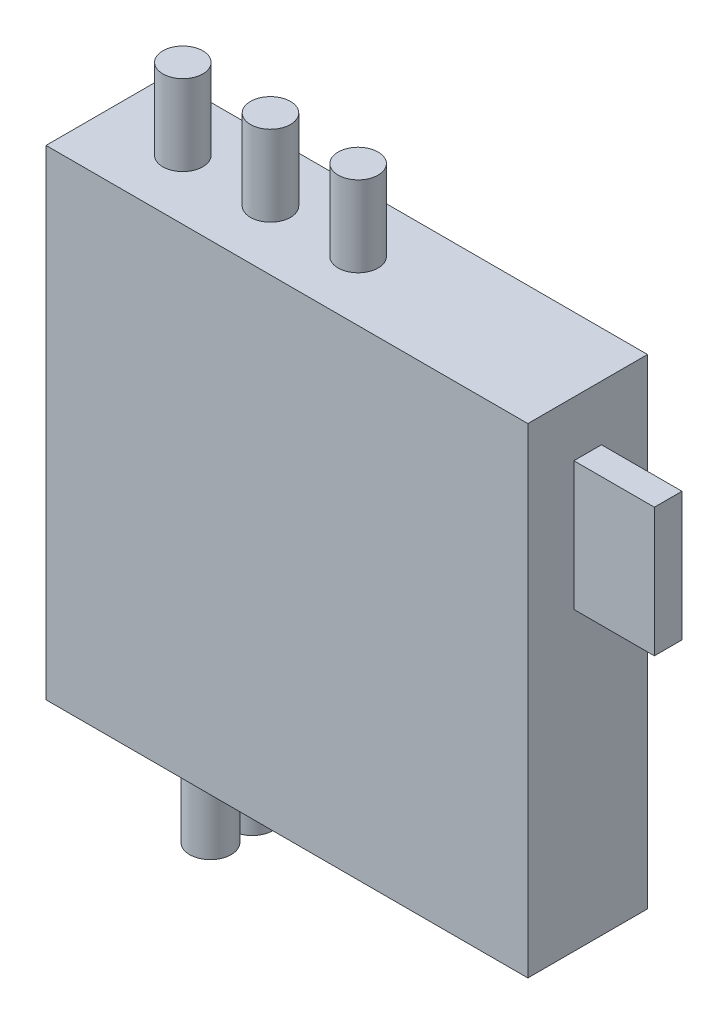
ISO-10303-21;
HEADER;
FILE_DESCRIPTION(('STEP AP214'),'2;1');
FILE_NAME('part.step','',(''),(''),'','','');
FILE_SCHEMA(('AUTOMOTIVE_DESIGN { 1 0 10303 214 1 1 1 1 }'));
ENDSEC;
DATA;
#1=APPLICATION_CONTEXT('core data for automotive mechanical design processes');
#2=APPLICATION_PROTOCOL_DEFINITION('international standard','automotive_design',2000,#1);
#3=PRODUCT_CONTEXT('',#1,'mechanical');
#4=PRODUCT('Part','Part','',(#3));
#5=PRODUCT_RELATED_PRODUCT_CATEGORY('part','',(#4));
#6=PRODUCT_DEFINITION_FORMATION('','',#4);
#7=PRODUCT_DEFINITION_CONTEXT('part definition',#1,'design');
#8=PRODUCT_DEFINITION('design','',#6,#7);
#9=PRODUCT_DEFINITION_SHAPE('','',#8);
#10=(LENGTH_UNIT() NAMED_UNIT(*) SI_UNIT(.MILLI.,.METRE.));
#11=(NAMED_UNIT(*) PLANE_ANGLE_UNIT() SI_UNIT($,.RADIAN.));
#12=(NAMED_UNIT(*) SI_UNIT($,.STERADIAN.) SOLID_ANGLE_UNIT());
#13=UNCERTAINTY_MEASURE_WITH_UNIT(LENGTH_MEASURE(1.E-05),#10,'distance_accuracy_value','');
#14=(GEOMETRIC_REPRESENTATION_CONTEXT(3) GLOBAL_UNCERTAINTY_ASSIGNED_CONTEXT((#13)) GLOBAL_UNIT_ASSIGNED_CONTEXT((#10,
#11,#12)) REPRESENTATION_CONTEXT('',''));
#15=CARTESIAN_POINT('',(0.,0.,0.));
#16=DIRECTION('',(0.,0.,1.));
#17=DIRECTION('',(1.,0.,0.));
#18=AXIS2_PLACEMENT_3D('',#15,#16,#17);
#19=CARTESIAN_POINT('',(26.19,52.2,-6.50499999999999));
#20=DIRECTION('',(-1.,0.,0.));
#21=DIRECTION('',(0.,0.,1.));
#22=AXIS2_PLACEMENT_3D('',#19,#20,#21);
#23=PLANE('',#22);
#24=DIRECTION('',(0.,0.,-1.));
#25=VECTOR('',#24,1.);
#26=CARTESIAN_POINT('',(26.19,0.,-6.50499999999999));
#27=LINE('',#26,#25);
#28=CARTESIAN_POINT('',(26.19,0.,6.505));
#29=VERTEX_POINT('',#28);
#30=CARTESIAN_POINT('',(26.19,0.,-6.50499999999999));
#31=VERTEX_POINT('',#30);
#32=EDGE_CURVE('E171',#29,#31,#27,.T.);
#33=ORIENTED_EDGE('',*,*,#32,.T.);
#34=DIRECTION('',(0.,-1.,0.));
#35=VECTOR('',#34,1.);
#36=CARTESIAN_POINT('',(26.19,52.2,-6.50499999999999));
#37=LINE('',#36,#35);
#38=CARTESIAN_POINT('',(26.19,52.2,-6.50499999999999));
#39=VERTEX_POINT('',#38);
#40=EDGE_CURVE('E176',#39,#31,#37,.T.);
#41=ORIENTED_EDGE('',*,*,#40,.F.);
#42=DIRECTION('',(0.,0.,-1.));
#43=VECTOR('',#42,1.);
#44=CARTESIAN_POINT('',(26.19,52.2,-6.50499999999999));
#45=LINE('',#44,#43);
#46=CARTESIAN_POINT('',(26.19,52.2,6.505));
#47=VERTEX_POINT('',#46);
#48=EDGE_CURVE('E162',#47,#39,#45,.T.);
#49=ORIENTED_EDGE('',*,*,#48,.F.);
#50=DIRECTION('',(0.,-1.,0.));
#51=VECTOR('',#50,1.);
#52=CARTESIAN_POINT('',(26.19,52.2,6.505));
#53=LINE('',#52,#51);
#54=EDGE_CURVE('E179',#47,#29,#53,.T.);
#55=ORIENTED_EDGE('',*,*,#54,.T.);
#56=EDGE_LOOP('',(#33,#41,#49,#55));
#57=FACE_BOUND('',#56,.T.);
#58=DIRECTION('',(0.,-1.,0.));
#59=VECTOR('',#58,1.);
#60=CARTESIAN_POINT('',(26.19,46.2,1.5));
#61=LINE('',#60,#59);
#62=CARTESIAN_POINT('',(26.19,46.2,1.5));
#63=VERTEX_POINT('',#62);
#64=CARTESIAN_POINT('',(26.19,32.2,1.5));
#65=VERTEX_POINT('',#64);
#66=EDGE_CURVE('E125',#63,#65,#61,.T.);
#67=ORIENTED_EDGE('',*,*,#66,.F.);
#68=DIRECTION('',(0.,0.,1.));
#69=VECTOR('',#68,1.);
#70=CARTESIAN_POINT('',(26.19,46.2,1.5));
#71=LINE('',#70,#69);
#72=CARTESIAN_POINT('',(26.19,46.2,-1.5));
#73=VERTEX_POINT('',#72);
#74=EDGE_CURVE('E122',#73,#63,#71,.T.);
#75=ORIENTED_EDGE('',*,*,#74,.F.);
#76=DIRECTION('',(0.,1.,0.));
#77=VECTOR('',#76,1.);
#78=CARTESIAN_POINT('',(26.19,46.2,-1.5));
#79=LINE('',#78,#77);
#80=CARTESIAN_POINT('',(26.19,32.2,-1.5));
#81=VERTEX_POINT('',#80);
#82=EDGE_CURVE('E60',#81,#73,#79,.T.);
#83=ORIENTED_EDGE('',*,*,#82,.F.);
#84=DIRECTION('',(0.,0.,-1.));
#85=VECTOR('',#84,1.);
#86=CARTESIAN_POINT('',(26.19,32.2,1.5));
#87=LINE('',#86,#85);
#88=EDGE_CURVE('E55',#65,#81,#87,.T.);
#89=ORIENTED_EDGE('',*,*,#88,.F.);
#90=EDGE_LOOP('',(#67,#75,#83,#89));
#91=FACE_BOUND('',#90,.T.);
#92=ADVANCED_FACE('F40',(#57,#91),#23,.F.);
#93=CARTESIAN_POINT('',(-26.19,52.2,-6.50499999999999));
#94=DIRECTION('',(1.,0.,0.));
#95=DIRECTION('',(0.,0.,-1.));
#96=AXIS2_PLACEMENT_3D('',#93,#94,#95);
#97=PLANE('',#96);
#98=DIRECTION('',(0.,0.,1.));
#99=VECTOR('',#98,1.);
#100=CARTESIAN_POINT('',(-26.19,0.,-6.50499999999999));
#101=LINE('',#100,#99);
#102=CARTESIAN_POINT('',(-26.19,0.,-6.50499999999999));
#103=VERTEX_POINT('',#102);
#104=CARTESIAN_POINT('',(-26.19,0.,6.505));
#105=VERTEX_POINT('',#104);
#106=EDGE_CURVE('E155',#103,#105,#101,.T.);
#107=ORIENTED_EDGE('',*,*,#106,.T.);
#108=DIRECTION('',(0.,-1.,0.));
#109=VECTOR('',#108,1.);
#110=CARTESIAN_POINT('',(-26.19,52.2,6.505));
#111=LINE('',#110,#109);
#112=CARTESIAN_POINT('',(-26.19,52.2,6.505));
#113=VERTEX_POINT('',#112);
#114=EDGE_CURVE('E182',#113,#105,#111,.T.);
#115=ORIENTED_EDGE('',*,*,#114,.F.);
#116=DIRECTION('',(0.,0.,1.));
#117=VECTOR('',#116,1.);
#118=CARTESIAN_POINT('',(-26.19,52.2,-6.50499999999999));
#119=LINE('',#118,#117);
#120=CARTESIAN_POINT('',(-26.19,52.2,-6.50499999999999));
#121=VERTEX_POINT('',#120);
#122=EDGE_CURVE('E156',#121,#113,#119,.T.);
#123=ORIENTED_EDGE('',*,*,#122,.F.);
#124=DIRECTION('',(0.,-1.,0.));
#125=VECTOR('',#124,1.);
#126=CARTESIAN_POINT('',(-26.19,52.2,-6.50499999999999));
#127=LINE('',#126,#125);
#128=EDGE_CURVE('E166',#121,#103,#127,.T.);
#129=ORIENTED_EDGE('',*,*,#128,.T.);
#130=EDGE_LOOP('',(#107,#115,#123,#129));
#131=FACE_BOUND('',#130,.T.);
#132=ADVANCED_FACE('F42',(#131),#97,.F.);
#133=CARTESIAN_POINT('',(-26.19,52.2,6.505));
#134=DIRECTION('',(0.,0.,-1.));
#135=DIRECTION('',(-1.,0.,0.));
#136=AXIS2_PLACEMENT_3D('',#133,#134,#135);
#137=PLANE('',#136);
#138=DIRECTION('',(1.,0.,0.));
#139=VECTOR('',#138,1.);
#140=CARTESIAN_POINT('',(-26.19,0.,6.505));
#141=LINE('',#140,#139);
#142=EDGE_CURVE('E169',#105,#29,#141,.T.);
#143=ORIENTED_EDGE('',*,*,#142,.T.);
#144=ORIENTED_EDGE('',*,*,#54,.F.);
#145=DIRECTION('',(1.,0.,0.));
#146=VECTOR('',#145,1.);
#147=CARTESIAN_POINT('',(-26.19,52.2,6.505));
#148=LINE('',#147,#146);
#149=EDGE_CURVE('E159',#113,#47,#148,.T.);
#150=ORIENTED_EDGE('',*,*,#149,.F.);
#151=ORIENTED_EDGE('',*,*,#114,.T.);
#152=EDGE_LOOP('',(#143,#144,#150,#151));
#153=FACE_BOUND('',#152,.T.);
#154=ADVANCED_FACE('F210',(#153),#137,.F.);
#155=CARTESIAN_POINT('',(-26.19,52.2,-6.50499999999999));
#156=DIRECTION('',(0.,0.,1.));
#157=DIRECTION('',(1.,0.,0.));
#158=AXIS2_PLACEMENT_3D('',#155,#156,#157);
#159=PLANE('',#158);
#160=DIRECTION('',(-1.,0.,0.));
#161=VECTOR('',#160,1.);
#162=CARTESIAN_POINT('',(-26.19,0.,-6.50499999999999));
#163=LINE('',#162,#161);
#164=EDGE_CURVE('E160',#31,#103,#163,.T.);
#165=ORIENTED_EDGE('',*,*,#164,.T.);
#166=ORIENTED_EDGE('',*,*,#128,.F.);
#167=DIRECTION('',(-1.,0.,0.));
#168=VECTOR('',#167,1.);
#169=CARTESIAN_POINT('',(-26.19,52.2,-6.50499999999999));
#170=LINE('',#169,#168);
#171=EDGE_CURVE('E164',#39,#121,#170,.T.);
#172=ORIENTED_EDGE('',*,*,#171,.F.);
#173=ORIENTED_EDGE('',*,*,#40,.T.);
#174=EDGE_LOOP('',(#165,#166,#172,#173));
#175=FACE_BOUND('',#174,.T.);
#176=ADVANCED_FACE('F204',(#175),#159,.F.);
#177=CARTESIAN_POINT('',(0.,52.2,0.));
#178=DIRECTION('',(0.,1.,0.));
#179=DIRECTION('',(0.,0.,1.));
#180=AXIS2_PLACEMENT_3D('',#177,#178,#179);
#181=PLANE('',#180);
#182=CARTESIAN_POINT('',(1.23499999999999,52.2,-2.661905372734E-13));
#183=DIRECTION('',(0.,1.,0.));
#184=DIRECTION('',(0.,0.,1.));
#185=AXIS2_PLACEMENT_3D('',#182,#183,#184);
#186=CIRCLE('',#185,2.175);
#187=CARTESIAN_POINT('',(1.23499999999999,52.2,2.17499999999973));
#188=VERTEX_POINT('',#187);
#189=EDGE_CURVE('E129',#188,#188,#186,.T.);
#190=ORIENTED_EDGE('',*,*,#189,.F.);
#191=EDGE_LOOP('',(#190));
#192=FACE_BOUND('',#191,.T.);
#193=CARTESIAN_POINT('',(-8.29500000000001,52.2,-1.330952686367E-13));
#194=DIRECTION('',(0.,1.,0.));
#195=DIRECTION('',(0.,0.,1.));
#196=AXIS2_PLACEMENT_3D('',#193,#194,#195);
#197=CIRCLE('',#196,2.175);
#198=CARTESIAN_POINT('',(-8.29500000000001,52.2,2.17499999999987));
#199=VERTEX_POINT('',#198);
#200=EDGE_CURVE('E138',#199,#199,#197,.T.);
#201=ORIENTED_EDGE('',*,*,#200,.F.);
#202=EDGE_LOOP('',(#201));
#203=FACE_BOUND('',#202,.T.);
#204=CARTESIAN_POINT('',(-17.8250000000001,52.2,3.66026653431106E-13));
#205=DIRECTION('',(0.,1.,0.));
#206=DIRECTION('',(0.,0.,1.));
#207=AXIS2_PLACEMENT_3D('',#204,#205,#206);
#208=CIRCLE('',#207,2.17500000000019);
#209=CARTESIAN_POINT('',(-17.8250000000001,52.2,2.17500000000056));
#210=VERTEX_POINT('',#209);
#211=EDGE_CURVE('E141',#210,#210,#208,.T.);
#212=ORIENTED_EDGE('',*,*,#211,.F.);
#213=EDGE_LOOP('',(#212));
#214=FACE_BOUND('',#213,.T.);
#215=ORIENTED_EDGE('',*,*,#122,.T.);
#216=ORIENTED_EDGE('',*,*,#149,.T.);
#217=ORIENTED_EDGE('',*,*,#48,.T.);
#218=ORIENTED_EDGE('',*,*,#171,.T.);
#219=EDGE_LOOP('',(#215,#216,#217,#218));
#220=FACE_BOUND('',#219,.T.);
#221=ADVANCED_FACE('F192',(#192,#203,#214,#220),#181,.T.);
#222=CARTESIAN_POINT('',(0.,0.,0.));
#223=DIRECTION('',(0.,1.,0.));
#224=DIRECTION('',(0.,0.,1.));
#225=AXIS2_PLACEMENT_3D('',#222,#223,#224);
#226=PLANE('',#225);
#227=CARTESIAN_POINT('',(-12.55,0.,-2.27));
#228=DIRECTION('',(0.,1.,0.));
#229=DIRECTION('',(0.,0.,1.));
#230=AXIS2_PLACEMENT_3D('',#227,#228,#229);
#231=CIRCLE('',#230,2.26);
#232=CARTESIAN_POINT('',(-12.55,0.,-0.00999999999999742));
#233=VERTEX_POINT('',#232);
#234=EDGE_CURVE('E11',#233,#233,#231,.F.);
#235=ORIENTED_EDGE('',*,*,#234,.F.);
#236=EDGE_LOOP('',(#235));
#237=FACE_BOUND('',#236,.T.);
#238=CARTESIAN_POINT('',(-12.55,0.,2.27));
#239=DIRECTION('',(0.,1.,0.));
#240=DIRECTION('',(0.,0.,1.));
#241=AXIS2_PLACEMENT_3D('',#238,#239,#240);
#242=CIRCLE('',#241,2.26);
#243=CARTESIAN_POINT('',(-12.55,0.,4.53));
#244=VERTEX_POINT('',#243);
#245=EDGE_CURVE('E48',#244,#244,#242,.F.);
#246=ORIENTED_EDGE('',*,*,#245,.F.);
#247=EDGE_LOOP('',(#246));
#248=FACE_BOUND('',#247,.T.);
#249=ORIENTED_EDGE('',*,*,#106,.F.);
#250=ORIENTED_EDGE('',*,*,#164,.F.);
#251=ORIENTED_EDGE('',*,*,#32,.F.);
#252=ORIENTED_EDGE('',*,*,#142,.F.);
#253=EDGE_LOOP('',(#249,#250,#251,#252));
#254=FACE_BOUND('',#253,.T.);
#255=ADVANCED_FACE('F189',(#237,#248,#254),#226,.F.);
#256=CARTESIAN_POINT('',(-12.55,-8.75,2.27));
#257=DIRECTION('',(0.,1.,0.));
#258=DIRECTION('',(0.,0.,1.));
#259=AXIS2_PLACEMENT_3D('',#256,#257,#258);
#260=CYLINDRICAL_SURFACE('',#259,2.26);
#261=CARTESIAN_POINT('',(-12.55,-8.75,2.27));
#262=DIRECTION('',(0.,-1.,0.));
#263=DIRECTION('',(0.,0.,-1.));
#264=AXIS2_PLACEMENT_3D('',#261,#262,#263);
#265=CIRCLE('',#264,2.26);
#266=CARTESIAN_POINT('',(-12.55,-8.75,0.0100000000000009));
#267=VERTEX_POINT('',#266);
#268=EDGE_CURVE('E152',#267,#267,#265,.T.);
#269=ORIENTED_EDGE('',*,*,#268,.F.);
#270=EDGE_LOOP('',(#269));
#271=FACE_BOUND('',#270,.T.);
#272=ORIENTED_EDGE('',*,*,#245,.T.);
#273=EDGE_LOOP('',(#272));
#274=FACE_BOUND('',#273,.T.);
#275=ADVANCED_FACE('F187',(#271,#274),#260,.T.);
#276=CARTESIAN_POINT('',(-12.55,-8.75,2.27));
#277=DIRECTION('',(0.,-1.,0.));
#278=DIRECTION('',(0.,0.,-1.));
#279=AXIS2_PLACEMENT_3D('',#276,#277,#278);
#280=PLANE('',#279);
#281=ORIENTED_EDGE('',*,*,#268,.T.);
#282=EDGE_LOOP('',(#281));
#283=FACE_BOUND('',#282,.T.);
#284=ADVANCED_FACE('F256',(#283),#280,.T.);
#285=CARTESIAN_POINT('',(-12.55,-8.75,-2.27));
#286=DIRECTION('',(0.,1.,0.));
#287=DIRECTION('',(0.,0.,1.));
#288=AXIS2_PLACEMENT_3D('',#285,#286,#287);
#289=CYLINDRICAL_SURFACE('',#288,2.26);
#290=CARTESIAN_POINT('',(-12.55,-8.75,-2.27));
#291=DIRECTION('',(0.,-1.,0.));
#292=DIRECTION('',(0.,0.,1.));
#293=AXIS2_PLACEMENT_3D('',#290,#291,#292);
#294=CIRCLE('',#293,2.26);
#295=CARTESIAN_POINT('',(-12.55,-8.75,-0.00999999999999742));
#296=VERTEX_POINT('',#295);
#297=EDGE_CURVE('E147',#296,#296,#294,.T.);
#298=ORIENTED_EDGE('',*,*,#297,.F.);
#299=EDGE_LOOP('',(#298));
#300=FACE_BOUND('',#299,.T.);
#301=ORIENTED_EDGE('',*,*,#234,.T.);
#302=EDGE_LOOP('',(#301));
#303=FACE_BOUND('',#302,.T.);
#304=ADVANCED_FACE('F266',(#300,#303),#289,.T.);
#305=CARTESIAN_POINT('',(-12.55,-8.75,-2.27));
#306=DIRECTION('',(0.,1.,0.));
#307=DIRECTION('',(0.,0.,1.));
#308=AXIS2_PLACEMENT_3D('',#305,#306,#307);
#309=PLANE('',#308);
#310=ORIENTED_EDGE('',*,*,#297,.T.);
#311=EDGE_LOOP('',(#310));
#312=FACE_BOUND('',#311,.T.);
#313=ADVANCED_FACE('F277',(#312),#309,.F.);
#314=CARTESIAN_POINT('',(-17.8250000000001,60.95,3.66026653431106E-13));
#315=DIRECTION('',(0.,-1.,0.));
#316=DIRECTION('',(0.,0.,-1.));
#317=AXIS2_PLACEMENT_3D('',#314,#315,#316);
#318=CYLINDRICAL_SURFACE('',#317,2.17500000000019);
#319=CARTESIAN_POINT('',(-17.8250000000001,60.95,3.66026653431106E-13));
#320=DIRECTION('',(0.,1.,0.));
#321=DIRECTION('',(0.,0.,1.));
#322=AXIS2_PLACEMENT_3D('',#319,#320,#321);
#323=CIRCLE('',#322,2.17500000000019);
#324=CARTESIAN_POINT('',(-17.8250000000001,60.95,2.17500000000056));
#325=VERTEX_POINT('',#324);
#326=EDGE_CURVE('E144',#325,#325,#323,.T.);
#327=ORIENTED_EDGE('',*,*,#326,.F.);
#328=EDGE_LOOP('',(#327));
#329=FACE_BOUND('',#328,.T.);
#330=ORIENTED_EDGE('',*,*,#211,.T.);
#331=EDGE_LOOP('',(#330));
#332=FACE_BOUND('',#331,.T.);
#333=ADVANCED_FACE('F287',(#329,#332),#318,.T.);
#334=CARTESIAN_POINT('',(-17.8250000000001,60.95,3.66026653431106E-13));
#335=DIRECTION('',(0.,1.,0.));
#336=DIRECTION('',(0.,0.,1.));
#337=AXIS2_PLACEMENT_3D('',#334,#335,#336);
#338=PLANE('',#337);
#339=ORIENTED_EDGE('',*,*,#326,.T.);
#340=EDGE_LOOP('',(#339));
#341=FACE_BOUND('',#340,.T.);
#342=ADVANCED_FACE('F303',(#341),#338,.T.);
#343=CARTESIAN_POINT('',(-8.29500000000001,60.95,-1.330952686367E-13));
#344=DIRECTION('',(0.,-1.,0.));
#345=DIRECTION('',(0.,0.,-1.));
#346=AXIS2_PLACEMENT_3D('',#343,#344,#345);
#347=CYLINDRICAL_SURFACE('',#346,2.175);
#348=CARTESIAN_POINT('',(-8.29500000000001,60.95,-1.330952686367E-13));
#349=DIRECTION('',(0.,1.,0.));
#350=DIRECTION('',(0.,0.,1.));
#351=AXIS2_PLACEMENT_3D('',#348,#349,#350);
#352=CIRCLE('',#351,2.175);
#353=CARTESIAN_POINT('',(-8.29500000000001,60.95,2.17499999999987));
#354=VERTEX_POINT('',#353);
#355=EDGE_CURVE('E136',#354,#354,#352,.T.);
#356=ORIENTED_EDGE('',*,*,#355,.F.);
#357=EDGE_LOOP('',(#356));
#358=FACE_BOUND('',#357,.T.);
#359=ORIENTED_EDGE('',*,*,#200,.T.);
#360=EDGE_LOOP('',(#359));
#361=FACE_BOUND('',#360,.T.);
#362=ADVANCED_FACE('F314',(#358,#361),#347,.T.);
#363=CARTESIAN_POINT('',(-8.29500000000001,60.95,-1.330952686367E-13));
#364=DIRECTION('',(0.,1.,0.));
#365=DIRECTION('',(0.,0.,1.));
#366=AXIS2_PLACEMENT_3D('',#363,#364,#365);
#367=PLANE('',#366);
#368=ORIENTED_EDGE('',*,*,#355,.T.);
#369=EDGE_LOOP('',(#368));
#370=FACE_BOUND('',#369,.T.);
#371=ADVANCED_FACE('F325',(#370),#367,.T.);
#372=CARTESIAN_POINT('',(1.23499999999999,60.95,-2.661905372734E-13));
#373=DIRECTION('',(0.,-1.,0.));
#374=DIRECTION('',(0.,0.,-1.));
#375=AXIS2_PLACEMENT_3D('',#372,#373,#374);
#376=CYLINDRICAL_SURFACE('',#375,2.175);
#377=CARTESIAN_POINT('',(1.23499999999999,60.95,-2.661905372734E-13));
#378=DIRECTION('',(0.,1.,0.));
#379=DIRECTION('',(0.,0.,1.));
#380=AXIS2_PLACEMENT_3D('',#377,#378,#379);
#381=CIRCLE('',#380,2.175);
#382=CARTESIAN_POINT('',(1.23499999999999,60.95,2.17499999999973));
#383=VERTEX_POINT('',#382);
#384=EDGE_CURVE('E126',#383,#383,#381,.T.);
#385=ORIENTED_EDGE('',*,*,#384,.F.);
#386=EDGE_LOOP('',(#385));
#387=FACE_BOUND('',#386,.T.);
#388=ORIENTED_EDGE('',*,*,#189,.T.);
#389=EDGE_LOOP('',(#388));
#390=FACE_BOUND('',#389,.T.);
#391=ADVANCED_FACE('F336',(#387,#390),#376,.T.);
#392=CARTESIAN_POINT('',(1.23499999999999,60.95,-2.661905372734E-13));
#393=DIRECTION('',(0.,1.,0.));
#394=DIRECTION('',(0.,0.,1.));
#395=AXIS2_PLACEMENT_3D('',#392,#393,#394);
#396=PLANE('',#395);
#397=ORIENTED_EDGE('',*,*,#384,.T.);
#398=EDGE_LOOP('',(#397));
#399=FACE_BOUND('',#398,.T.);
#400=ADVANCED_FACE('F346',(#399),#396,.T.);
#401=CARTESIAN_POINT('',(34.94,46.2,1.5));
#402=DIRECTION('',(0.,0.,-1.));
#403=DIRECTION('',(0.,1.,0.));
#404=AXIS2_PLACEMENT_3D('',#401,#402,#403);
#405=PLANE('',#404);
#406=ORIENTED_EDGE('',*,*,#66,.T.);
#407=DIRECTION('',(-1.,0.,0.));
#408=VECTOR('',#407,1.);
#409=CARTESIAN_POINT('',(34.94,32.2,1.5));
#410=LINE('',#409,#408);
#411=CARTESIAN_POINT('',(34.94,32.2,1.5));
#412=VERTEX_POINT('',#411);
#413=EDGE_CURVE('E106',#412,#65,#410,.T.);
#414=ORIENTED_EDGE('',*,*,#413,.F.);
#415=DIRECTION('',(0.,-1.,0.));
#416=VECTOR('',#415,1.);
#417=CARTESIAN_POINT('',(34.94,46.2,1.5));
#418=LINE('',#417,#416);
#419=CARTESIAN_POINT('',(34.94,46.2,1.5));
#420=VERTEX_POINT('',#419);
#421=EDGE_CURVE('E113',#420,#412,#418,.T.);
#422=ORIENTED_EDGE('',*,*,#421,.F.);
#423=DIRECTION('',(-1.,0.,0.));
#424=VECTOR('',#423,1.);
#425=CARTESIAN_POINT('',(34.94,46.2,1.5));
#426=LINE('',#425,#424);
#427=EDGE_CURVE('E446',#420,#63,#426,.T.);
#428=ORIENTED_EDGE('',*,*,#427,.T.);
#429=EDGE_LOOP('',(#406,#414,#422,#428));
#430=FACE_BOUND('',#429,.T.);
#431=ADVANCED_FACE('F124',(#430),#405,.F.);
#432=CARTESIAN_POINT('',(34.94,32.2,1.5));
#433=DIRECTION('',(0.,1.,0.));
#434=DIRECTION('',(0.,0.,1.));
#435=AXIS2_PLACEMENT_3D('',#432,#433,#434);
#436=PLANE('',#435);
#437=ORIENTED_EDGE('',*,*,#88,.T.);
#438=DIRECTION('',(-1.,0.,0.));
#439=VECTOR('',#438,1.);
#440=CARTESIAN_POINT('',(34.94,32.2,-1.5));
#441=LINE('',#440,#439);
#442=CARTESIAN_POINT('',(34.94,32.2,-1.5));
#443=VERTEX_POINT('',#442);
#444=EDGE_CURVE('E109',#443,#81,#441,.T.);
#445=ORIENTED_EDGE('',*,*,#444,.F.);
#446=DIRECTION('',(0.,0.,-1.));
#447=VECTOR('',#446,1.);
#448=CARTESIAN_POINT('',(34.94,32.2,1.5));
#449=LINE('',#448,#447);
#450=EDGE_CURVE('E102',#412,#443,#449,.T.);
#451=ORIENTED_EDGE('',*,*,#450,.F.);
#452=ORIENTED_EDGE('',*,*,#413,.T.);
#453=EDGE_LOOP('',(#437,#445,#451,#452));
#454=FACE_BOUND('',#453,.T.);
#455=ADVANCED_FACE('F104',(#454),#436,.F.);
#456=CARTESIAN_POINT('',(34.94,46.2,-1.5));
#457=DIRECTION('',(0.,0.,1.));
#458=DIRECTION('',(0.,-1.,0.));
#459=AXIS2_PLACEMENT_3D('',#456,#457,#458);
#460=PLANE('',#459);
#461=ORIENTED_EDGE('',*,*,#82,.T.);
#462=DIRECTION('',(-1.,0.,0.));
#463=VECTOR('',#462,1.);
#464=CARTESIAN_POINT('',(34.94,46.2,-1.5));
#465=LINE('',#464,#463);
#466=CARTESIAN_POINT('',(34.94,46.2,-1.5));
#467=VERTEX_POINT('',#466);
#468=EDGE_CURVE('E131',#467,#73,#465,.T.);
#469=ORIENTED_EDGE('',*,*,#468,.F.);
#470=DIRECTION('',(0.,1.,0.));
#471=VECTOR('',#470,1.);
#472=CARTESIAN_POINT('',(34.94,46.2,-1.5));
#473=LINE('',#472,#471);
#474=EDGE_CURVE('E112',#443,#467,#473,.T.);
#475=ORIENTED_EDGE('',*,*,#474,.F.);
#476=ORIENTED_EDGE('',*,*,#444,.T.);
#477=EDGE_LOOP('',(#461,#469,#475,#476));
#478=FACE_BOUND('',#477,.T.);
#479=ADVANCED_FACE('F376',(#478),#460,.F.);
#480=CARTESIAN_POINT('',(34.94,46.2,1.5));
#481=DIRECTION('',(0.,-1.,0.));
#482=DIRECTION('',(0.,0.,-1.));
#483=AXIS2_PLACEMENT_3D('',#480,#481,#482);
#484=PLANE('',#483);
#485=ORIENTED_EDGE('',*,*,#74,.T.);
#486=ORIENTED_EDGE('',*,*,#427,.F.);
#487=DIRECTION('',(0.,0.,1.));
#488=VECTOR('',#487,1.);
#489=CARTESIAN_POINT('',(34.94,46.2,1.5));
#490=LINE('',#489,#488);
#491=EDGE_CURVE('E118',#467,#420,#490,.T.);
#492=ORIENTED_EDGE('',*,*,#491,.F.);
#493=ORIENTED_EDGE('',*,*,#468,.T.);
#494=EDGE_LOOP('',(#485,#486,#492,#493));
#495=FACE_BOUND('',#494,.T.);
#496=ADVANCED_FACE('F383',(#495),#484,.F.);
#497=CARTESIAN_POINT('',(34.94,0.,0.));
#498=DIRECTION('',(1.,0.,0.));
#499=DIRECTION('',(0.,0.,-1.));
#500=AXIS2_PLACEMENT_3D('',#497,#498,#499);
#501=PLANE('',#500);
#502=ORIENTED_EDGE('',*,*,#421,.T.);
#503=ORIENTED_EDGE('',*,*,#450,.T.);
#504=ORIENTED_EDGE('',*,*,#474,.T.);
#505=ORIENTED_EDGE('',*,*,#491,.T.);
#506=EDGE_LOOP('',(#502,#503,#504,#505));
#507=FACE_BOUND('',#506,.T.);
#508=ADVANCED_FACE('F116',(#507),#501,.T.);
#509=CLOSED_SHELL('',(#92,#132,#154,#176,#221,#255,#275,#284,#304,#313,#333,#342,#362,#371,#391,
#400,#431,#455,#479,#496,#508));
#510=MANIFOLD_SOLID_BREP('B2',#509);
#511=ADVANCED_BREP_SHAPE_REPRESENTATION('',(#18,#510),#14);
#512=SHAPE_DEFINITION_REPRESENTATION(#9,#511);
ENDSEC;
END-ISO-10303-21;
